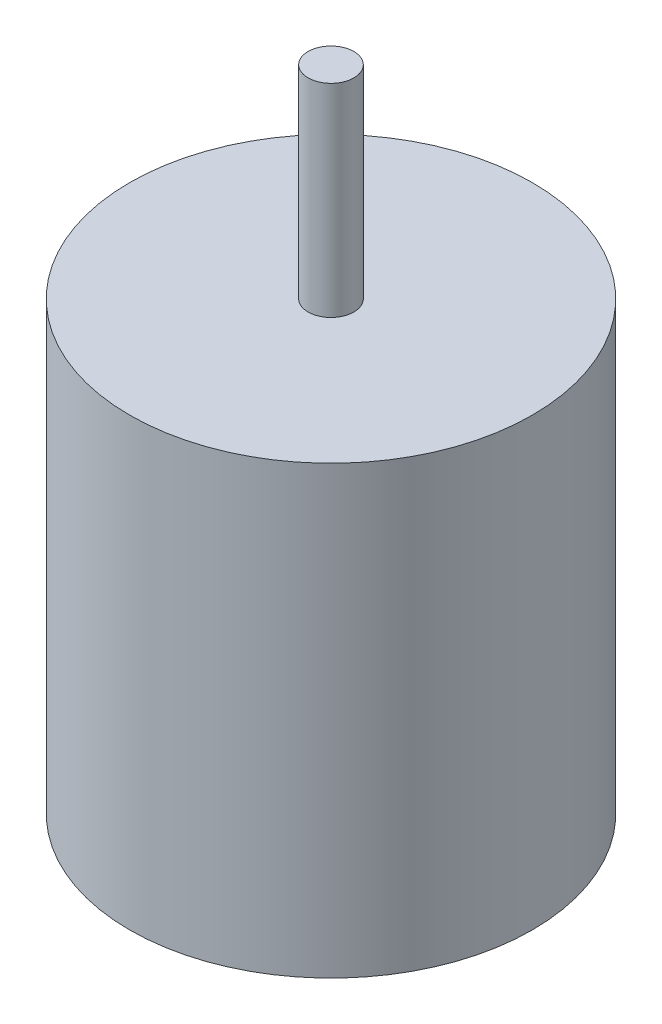
ISO-10303-21;
HEADER;
FILE_DESCRIPTION(('STEP AP214'),'2;1');
FILE_NAME('part.step','',(''),(''),'','','');
FILE_SCHEMA(('AUTOMOTIVE_DESIGN { 1 0 10303 214 1 1 1 1 }'));
ENDSEC;
DATA;
#1=APPLICATION_CONTEXT('core data for automotive mechanical design processes');
#2=APPLICATION_PROTOCOL_DEFINITION('international standard','automotive_design',2000,#1);
#3=PRODUCT_CONTEXT('',#1,'mechanical');
#4=PRODUCT('Part','Part','',(#3));
#5=PRODUCT_RELATED_PRODUCT_CATEGORY('part','',(#4));
#6=PRODUCT_DEFINITION_FORMATION('','',#4);
#7=PRODUCT_DEFINITION_CONTEXT('part definition',#1,'design');
#8=PRODUCT_DEFINITION('design','',#6,#7);
#9=PRODUCT_DEFINITION_SHAPE('','',#8);
#10=(LENGTH_UNIT() NAMED_UNIT(*) SI_UNIT(.MILLI.,.METRE.));
#11=(NAMED_UNIT(*) PLANE_ANGLE_UNIT() SI_UNIT($,.RADIAN.));
#12=(NAMED_UNIT(*) SI_UNIT($,.STERADIAN.) SOLID_ANGLE_UNIT());
#13=UNCERTAINTY_MEASURE_WITH_UNIT(LENGTH_MEASURE(1.E-05),#10,'distance_accuracy_value','');
#14=(GEOMETRIC_REPRESENTATION_CONTEXT(3) GLOBAL_UNCERTAINTY_ASSIGNED_CONTEXT((#13)) GLOBAL_UNIT_ASSIGNED_CONTEXT((#10,
#11,#12)) REPRESENTATION_CONTEXT('',''));
#15=CARTESIAN_POINT('',(0.,0.,0.));
#16=DIRECTION('',(0.,0.,1.));
#17=DIRECTION('',(1.,0.,0.));
#18=AXIS2_PLACEMENT_3D('',#15,#16,#17);
#19=CARTESIAN_POINT('',(0.,31.,0.));
#20=DIRECTION('',(0.,-1.,0.));
#21=DIRECTION('',(0.,0.,-1.));
#22=AXIS2_PLACEMENT_3D('',#19,#20,#21);
#23=CYLINDRICAL_SURFACE('',#22,14.);
#24=CARTESIAN_POINT('',(0.,31.,0.));
#25=DIRECTION('',(0.,1.,0.));
#26=DIRECTION('',(0.,0.,1.));
#27=AXIS2_PLACEMENT_3D('',#24,#25,#26);
#28=CIRCLE('',#27,14.);
#29=CARTESIAN_POINT('',(0.,31.,14.));
#30=VERTEX_POINT('',#29);
#31=EDGE_CURVE('E10',#30,#30,#28,.T.);
#32=ORIENTED_EDGE('',*,*,#31,.F.);
#33=EDGE_LOOP('',(#32));
#34=FACE_BOUND('',#33,.T.);
#35=CARTESIAN_POINT('',(0.,0.,0.));
#36=DIRECTION('',(0.,1.,0.));
#37=DIRECTION('',(0.,0.,1.));
#38=AXIS2_PLACEMENT_3D('',#35,#36,#37);
#39=CIRCLE('',#38,14.);
#40=CARTESIAN_POINT('',(0.,0.,14.));
#41=VERTEX_POINT('',#40);
#42=EDGE_CURVE('E36',#41,#41,#39,.T.);
#43=ORIENTED_EDGE('',*,*,#42,.T.);
#44=EDGE_LOOP('',(#43));
#45=FACE_BOUND('',#44,.T.);
#46=ADVANCED_FACE('F33',(#34,#45),#23,.T.);
#47=CARTESIAN_POINT('',(0.,31.,0.));
#48=DIRECTION('',(0.,1.,0.));
#49=DIRECTION('',(0.,0.,1.));
#50=AXIS2_PLACEMENT_3D('',#47,#48,#49);
#51=PLANE('',#50);
#52=CARTESIAN_POINT('',(0.,31.,0.));
#53=DIRECTION('',(0.,1.,0.));
#54=DIRECTION('',(0.,0.,1.));
#55=AXIS2_PLACEMENT_3D('',#52,#53,#54);
#56=CIRCLE('',#55,1.59);
#57=CARTESIAN_POINT('',(0.,31.,1.59));
#58=VERTEX_POINT('',#57);
#59=EDGE_CURVE('E43',#58,#58,#56,.F.);
#60=ORIENTED_EDGE('',*,*,#59,.T.);
#61=EDGE_LOOP('',(#60));
#62=FACE_BOUND('',#61,.T.);
#63=ORIENTED_EDGE('',*,*,#31,.T.);
#64=EDGE_LOOP('',(#63));
#65=FACE_BOUND('',#64,.T.);
#66=ADVANCED_FACE('F63',(#62,#65),#51,.T.);
#67=CARTESIAN_POINT('',(0.,0.,0.));
#68=DIRECTION('',(0.,1.,0.));
#69=DIRECTION('',(0.,0.,1.));
#70=AXIS2_PLACEMENT_3D('',#67,#68,#69);
#71=PLANE('',#70);
#72=ORIENTED_EDGE('',*,*,#42,.F.);
#73=EDGE_LOOP('',(#72));
#74=FACE_BOUND('',#73,.T.);
#75=ADVANCED_FACE('F55',(#74),#71,.F.);
#76=CARTESIAN_POINT('',(0.,45.1,0.));
#77=DIRECTION('',(0.,-1.,0.));
#78=DIRECTION('',(0.,0.,-1.));
#79=AXIS2_PLACEMENT_3D('',#76,#77,#78);
#80=CYLINDRICAL_SURFACE('',#79,1.59);
#81=ORIENTED_EDGE('',*,*,#59,.F.);
#82=EDGE_LOOP('',(#81));
#83=FACE_BOUND('',#82,.T.);
#84=CARTESIAN_POINT('',(0.,45.1,0.));
#85=DIRECTION('',(0.,1.,0.));
#86=DIRECTION('',(0.,0.,1.));
#87=AXIS2_PLACEMENT_3D('',#84,#85,#86);
#88=CIRCLE('',#87,1.59);
#89=CARTESIAN_POINT('',(0.,45.1,1.59));
#90=VERTEX_POINT('',#89);
#91=EDGE_CURVE('E47',#90,#90,#88,.T.);
#92=ORIENTED_EDGE('',*,*,#91,.F.);
#93=EDGE_LOOP('',(#92));
#94=FACE_BOUND('',#93,.T.);
#95=ADVANCED_FACE('F53',(#83,#94),#80,.T.);
#96=CARTESIAN_POINT('',(0.,45.1,0.));
#97=DIRECTION('',(0.,1.,0.));
#98=DIRECTION('',(0.,0.,1.));
#99=AXIS2_PLACEMENT_3D('',#96,#97,#98);
#100=PLANE('',#99);
#101=ORIENTED_EDGE('',*,*,#91,.T.);
#102=EDGE_LOOP('',(#101));
#103=FACE_BOUND('',#102,.T.);
#104=ADVANCED_FACE('F51',(#103),#100,.T.);
#105=CLOSED_SHELL('',(#46,#66,#75,#95,#104));
#106=MANIFOLD_SOLID_BREP('B2',#105);
#107=ADVANCED_BREP_SHAPE_REPRESENTATION('',(#18,#106),#14);
#108=SHAPE_DEFINITION_REPRESENTATION(#9,#107);
ENDSEC;
END-ISO-10303-21;
